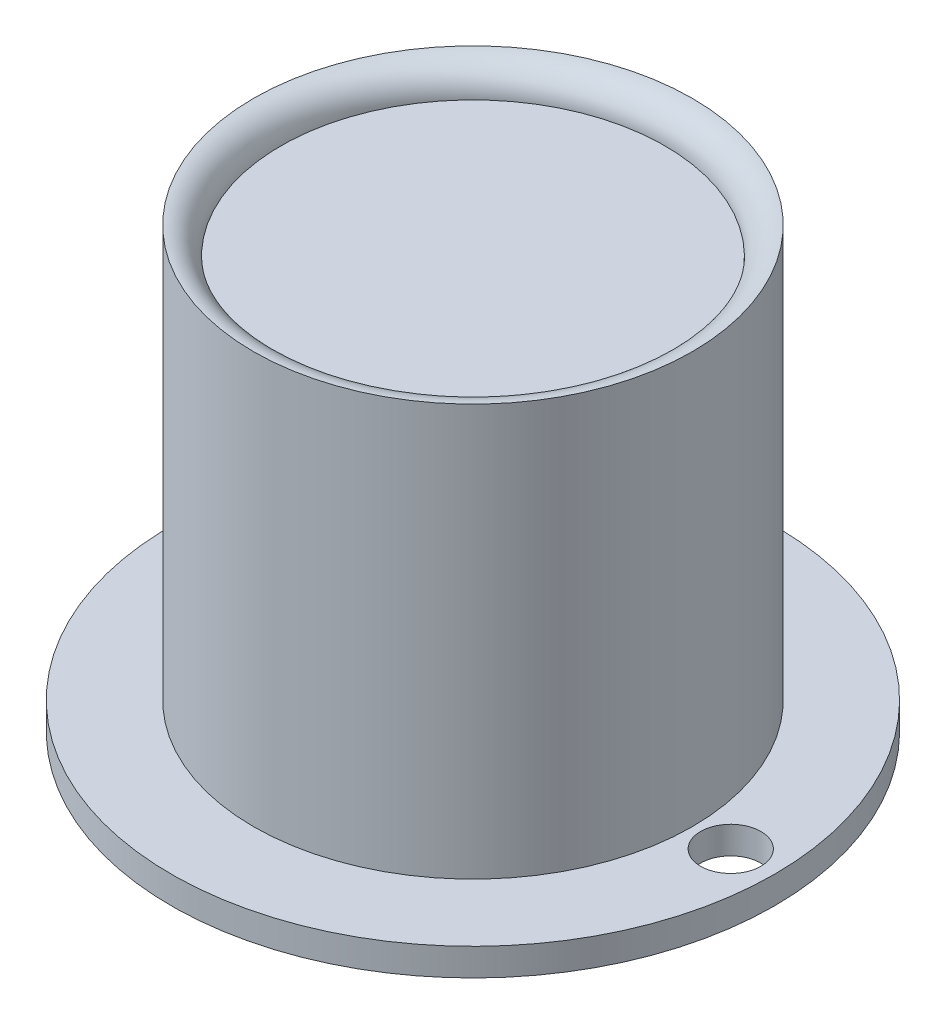
ISO-10303-21;
HEADER;
FILE_DESCRIPTION(('STEP AP214'),'2;1');
FILE_NAME('part.step','',(''),(''),'','','');
FILE_SCHEMA(('AUTOMOTIVE_DESIGN { 1 0 10303 214 1 1 1 1 }'));
ENDSEC;
DATA;
#1=APPLICATION_CONTEXT('core data for automotive mechanical design processes');
#2=APPLICATION_PROTOCOL_DEFINITION('international standard','automotive_design',2000,#1);
#3=PRODUCT_CONTEXT('',#1,'mechanical');
#4=PRODUCT('Part','Part','',(#3));
#5=PRODUCT_RELATED_PRODUCT_CATEGORY('part','',(#4));
#6=PRODUCT_DEFINITION_FORMATION('','',#4);
#7=PRODUCT_DEFINITION_CONTEXT('part definition',#1,'design');
#8=PRODUCT_DEFINITION('design','',#6,#7);
#9=PRODUCT_DEFINITION_SHAPE('','',#8);
#10=(LENGTH_UNIT() NAMED_UNIT(*) SI_UNIT(.MILLI.,.METRE.));
#11=(NAMED_UNIT(*) PLANE_ANGLE_UNIT() SI_UNIT($,.RADIAN.));
#12=(NAMED_UNIT(*) SI_UNIT($,.STERADIAN.) SOLID_ANGLE_UNIT());
#13=UNCERTAINTY_MEASURE_WITH_UNIT(LENGTH_MEASURE(1.E-05),#10,'distance_accuracy_value','');
#14=(GEOMETRIC_REPRESENTATION_CONTEXT(3) GLOBAL_UNCERTAINTY_ASSIGNED_CONTEXT((#13)) GLOBAL_UNIT_ASSIGNED_CONTEXT((#10,
#11,#12)) REPRESENTATION_CONTEXT('',''));
#15=CARTESIAN_POINT('',(0.,0.,0.));
#16=DIRECTION('',(0.,0.,1.));
#17=DIRECTION('',(1.,0.,0.));
#18=AXIS2_PLACEMENT_3D('',#15,#16,#17);
#19=CARTESIAN_POINT('',(0.,14.,0.));
#20=DIRECTION('',(0.,-1.,0.));
#21=DIRECTION('',(1.,0.,0.));
#22=AXIS2_PLACEMENT_3D('',#19,#20,#21);
#23=PLANE('',#22);
#24=CARTESIAN_POINT('',(0.,14.,0.));
#25=DIRECTION('',(0.,-1.,0.));
#26=DIRECTION('',(1.,0.,0.));
#27=AXIS2_PLACEMENT_3D('',#24,#25,#26);
#28=CIRCLE('',#27,7.);
#29=CARTESIAN_POINT('',(7.,14.,0.));
#30=VERTEX_POINT('',#29);
#31=EDGE_CURVE('E10',#30,#30,#28,.T.);
#32=ORIENTED_EDGE('',*,*,#31,.F.);
#33=EDGE_LOOP('',(#32));
#34=FACE_BOUND('',#33,.T.);
#35=ADVANCED_FACE('F39',(#34),#23,.F.);
#36=CARTESIAN_POINT('',(0.,14.,0.));
#37=DIRECTION('',(0.,-1.,0.));
#38=DIRECTION('',(1.,0.,0.));
#39=AXIS2_PLACEMENT_3D('',#36,#37,#38);
#40=TOROIDAL_SURFACE('',#39,8.,1.);
#41=CARTESIAN_POINT('',(0.,15.,0.));
#42=DIRECTION('',(0.,-1.,0.));
#43=DIRECTION('',(1.,0.,0.));
#44=AXIS2_PLACEMENT_3D('',#41,#42,#43);
#45=CIRCLE('',#44,8.);
#46=CARTESIAN_POINT('',(8.,15.,0.));
#47=VERTEX_POINT('',#46);
#48=EDGE_CURVE('E45',#47,#47,#45,.T.);
#49=ORIENTED_EDGE('',*,*,#48,.F.);
#50=EDGE_LOOP('',(#49));
#51=FACE_BOUND('',#50,.T.);
#52=ORIENTED_EDGE('',*,*,#31,.T.);
#53=EDGE_LOOP('',(#52));
#54=FACE_BOUND('',#53,.T.);
#55=ADVANCED_FACE('F112',(#51,#54),#40,.T.);
#56=CARTESIAN_POINT('',(0.,0.,0.));
#57=DIRECTION('',(0.,-1.,0.));
#58=DIRECTION('',(1.,0.,0.));
#59=AXIS2_PLACEMENT_3D('',#56,#57,#58);
#60=CYLINDRICAL_SURFACE('',#59,8.);
#61=CARTESIAN_POINT('',(0.,0.,0.));
#62=DIRECTION('',(0.,-1.,0.));
#63=DIRECTION('',(1.,0.,0.));
#64=AXIS2_PLACEMENT_3D('',#61,#62,#63);
#65=CIRCLE('',#64,8.);
#66=CARTESIAN_POINT('',(8.,0.,0.));
#67=VERTEX_POINT('',#66);
#68=EDGE_CURVE('E49',#67,#67,#65,.T.);
#69=ORIENTED_EDGE('',*,*,#68,.F.);
#70=EDGE_LOOP('',(#69));
#71=FACE_BOUND('',#70,.T.);
#72=ORIENTED_EDGE('',*,*,#48,.T.);
#73=EDGE_LOOP('',(#72));
#74=FACE_BOUND('',#73,.T.);
#75=ADVANCED_FACE('F86',(#71,#74),#60,.T.);
#76=CARTESIAN_POINT('',(0.,-1.,0.));
#77=DIRECTION('',(0.,-1.,0.));
#78=DIRECTION('',(1.,0.,0.));
#79=AXIS2_PLACEMENT_3D('',#76,#77,#78);
#80=PLANE('',#79);
#81=CARTESIAN_POINT('',(9.4,-0.999999999999999,0.));
#82=DIRECTION('',(0.,-1.,0.));
#83=DIRECTION('',(1.,0.,0.));
#84=AXIS2_PLACEMENT_3D('',#81,#82,#83);
#85=CIRCLE('',#84,1.1);
#86=CARTESIAN_POINT('',(10.5,-0.999999999999999,0.));
#87=VERTEX_POINT('',#86);
#88=EDGE_CURVE('E71',#87,#87,#85,.T.);
#89=ORIENTED_EDGE('',*,*,#88,.F.);
#90=EDGE_LOOP('',(#89));
#91=FACE_BOUND('',#90,.T.);
#92=CARTESIAN_POINT('',(-9.4,-1.,0.));
#93=DIRECTION('',(0.,-1.,0.));
#94=DIRECTION('',(-1.,0.,0.));
#95=AXIS2_PLACEMENT_3D('',#92,#93,#94);
#96=CIRCLE('',#95,1.1);
#97=CARTESIAN_POINT('',(-10.5,-1.,0.));
#98=VERTEX_POINT('',#97);
#99=EDGE_CURVE('E68',#98,#98,#96,.T.);
#100=ORIENTED_EDGE('',*,*,#99,.F.);
#101=EDGE_LOOP('',(#100));
#102=FACE_BOUND('',#101,.T.);
#103=CARTESIAN_POINT('',(0.,-1.,0.));
#104=DIRECTION('',(0.,-1.,0.));
#105=DIRECTION('',(1.,0.,0.));
#106=AXIS2_PLACEMENT_3D('',#103,#104,#105);
#107=CIRCLE('',#106,11.);
#108=CARTESIAN_POINT('',(11.,-0.999999999999999,0.));
#109=VERTEX_POINT('',#108);
#110=EDGE_CURVE('E58',#109,#109,#107,.T.);
#111=ORIENTED_EDGE('',*,*,#110,.T.);
#112=EDGE_LOOP('',(#111));
#113=FACE_BOUND('',#112,.T.);
#114=CARTESIAN_POINT('',(0.,-1.,0.));
#115=DIRECTION('',(0.,-1.,0.));
#116=DIRECTION('',(1.,0.,0.));
#117=AXIS2_PLACEMENT_3D('',#114,#115,#116);
#118=CIRCLE('',#117,7.);
#119=CARTESIAN_POINT('',(7.,-1.,0.));
#120=VERTEX_POINT('',#119);
#121=EDGE_CURVE('E62',#120,#120,#118,.T.);
#122=ORIENTED_EDGE('',*,*,#121,.F.);
#123=EDGE_LOOP('',(#122));
#124=FACE_BOUND('',#123,.T.);
#125=ADVANCED_FACE('F82',(#91,#102,#113,#124),#80,.T.);
#126=CARTESIAN_POINT('',(0.,0.,0.));
#127=DIRECTION('',(0.,-1.,0.));
#128=DIRECTION('',(1.,0.,0.));
#129=AXIS2_PLACEMENT_3D('',#126,#127,#128);
#130=PLANE('',#129);
#131=CARTESIAN_POINT('',(9.4,0.,0.));
#132=DIRECTION('',(0.,-1.,0.));
#133=DIRECTION('',(1.,0.,0.));
#134=AXIS2_PLACEMENT_3D('',#131,#132,#133);
#135=CIRCLE('',#134,1.1);
#136=CARTESIAN_POINT('',(10.5,0.,0.));
#137=VERTEX_POINT('',#136);
#138=EDGE_CURVE('E67',#137,#137,#135,.F.);
#139=ORIENTED_EDGE('',*,*,#138,.F.);
#140=EDGE_LOOP('',(#139));
#141=FACE_BOUND('',#140,.T.);
#142=CARTESIAN_POINT('',(-9.4,0.,0.));
#143=DIRECTION('',(0.,-1.,0.));
#144=DIRECTION('',(1.,0.,0.));
#145=AXIS2_PLACEMENT_3D('',#142,#143,#144);
#146=CIRCLE('',#145,1.1);
#147=CARTESIAN_POINT('',(-8.3,0.,0.));
#148=VERTEX_POINT('',#147);
#149=EDGE_CURVE('E72',#148,#148,#146,.F.);
#150=ORIENTED_EDGE('',*,*,#149,.F.);
#151=EDGE_LOOP('',(#150));
#152=FACE_BOUND('',#151,.T.);
#153=ORIENTED_EDGE('',*,*,#68,.T.);
#154=EDGE_LOOP('',(#153));
#155=FACE_BOUND('',#154,.T.);
#156=CARTESIAN_POINT('',(0.,0.,0.));
#157=DIRECTION('',(0.,-1.,0.));
#158=DIRECTION('',(1.,0.,0.));
#159=AXIS2_PLACEMENT_3D('',#156,#157,#158);
#160=CIRCLE('',#159,11.);
#161=CARTESIAN_POINT('',(11.,0.,0.));
#162=VERTEX_POINT('',#161);
#163=EDGE_CURVE('E59',#162,#162,#160,.T.);
#164=ORIENTED_EDGE('',*,*,#163,.F.);
#165=EDGE_LOOP('',(#164));
#166=FACE_BOUND('',#165,.T.);
#167=ADVANCED_FACE('F85',(#141,#152,#155,#166),#130,.F.);
#168=CARTESIAN_POINT('',(0.,-1.,0.));
#169=DIRECTION('',(0.,1.,0.));
#170=DIRECTION('',(-1.,0.,0.));
#171=AXIS2_PLACEMENT_3D('',#168,#169,#170);
#172=CYLINDRICAL_SURFACE('',#171,11.);
#173=ORIENTED_EDGE('',*,*,#110,.F.);
#174=EDGE_LOOP('',(#173));
#175=FACE_BOUND('',#174,.T.);
#176=ORIENTED_EDGE('',*,*,#163,.T.);
#177=EDGE_LOOP('',(#176));
#178=FACE_BOUND('',#177,.T.);
#179=ADVANCED_FACE('F106',(#175,#178),#172,.T.);
#180=CARTESIAN_POINT('',(0.,10.,0.));
#181=DIRECTION('',(0.,-1.,0.));
#182=DIRECTION('',(1.,0.,0.));
#183=AXIS2_PLACEMENT_3D('',#180,#181,#182);
#184=PLANE('',#183);
#185=CARTESIAN_POINT('',(0.,10.,0.));
#186=DIRECTION('',(0.,-1.,0.));
#187=DIRECTION('',(1.,0.,0.));
#188=AXIS2_PLACEMENT_3D('',#185,#186,#187);
#189=CIRCLE('',#188,7.);
#190=CARTESIAN_POINT('',(7.,10.,0.));
#191=VERTEX_POINT('',#190);
#192=EDGE_CURVE('E53',#191,#191,#189,.T.);
#193=ORIENTED_EDGE('',*,*,#192,.T.);
#194=EDGE_LOOP('',(#193));
#195=FACE_BOUND('',#194,.T.);
#196=ADVANCED_FACE('F97',(#195),#184,.T.);
#197=CARTESIAN_POINT('',(0.,10.,0.));
#198=DIRECTION('',(0.,-1.,0.));
#199=DIRECTION('',(1.,0.,0.));
#200=AXIS2_PLACEMENT_3D('',#197,#198,#199);
#201=CYLINDRICAL_SURFACE('',#200,7.);
#202=ORIENTED_EDGE('',*,*,#192,.F.);
#203=EDGE_LOOP('',(#202));
#204=FACE_BOUND('',#203,.T.);
#205=ORIENTED_EDGE('',*,*,#121,.T.);
#206=EDGE_LOOP('',(#205));
#207=FACE_BOUND('',#206,.T.);
#208=ADVANCED_FACE('F94',(#204,#207),#201,.F.);
#209=CARTESIAN_POINT('',(-9.4,3.11126983722081,0.));
#210=DIRECTION('',(0.,-1.,0.));
#211=DIRECTION('',(1.,0.,0.));
#212=AXIS2_PLACEMENT_3D('',#209,#210,#211);
#213=CYLINDRICAL_SURFACE('',#212,1.1);
#214=ORIENTED_EDGE('',*,*,#149,.T.);
#215=EDGE_LOOP('',(#214));
#216=FACE_BOUND('',#215,.T.);
#217=ORIENTED_EDGE('',*,*,#99,.T.);
#218=EDGE_LOOP('',(#217));
#219=FACE_BOUND('',#218,.T.);
#220=ADVANCED_FACE('F96',(#216,#219),#213,.F.);
#221=CARTESIAN_POINT('',(9.4,3.11126983722081,0.));
#222=DIRECTION('',(0.,-1.,0.));
#223=DIRECTION('',(1.,0.,0.));
#224=AXIS2_PLACEMENT_3D('',#221,#222,#223);
#225=CYLINDRICAL_SURFACE('',#224,1.1);
#226=ORIENTED_EDGE('',*,*,#138,.T.);
#227=EDGE_LOOP('',(#226));
#228=FACE_BOUND('',#227,.T.);
#229=ORIENTED_EDGE('',*,*,#88,.T.);
#230=EDGE_LOOP('',(#229));
#231=FACE_BOUND('',#230,.T.);
#232=ADVANCED_FACE('F80',(#228,#231),#225,.F.);
#233=CLOSED_SHELL('',(#35,#55,#75,#125,#167,#179,#196,#208,#220,#232));
#234=MANIFOLD_SOLID_BREP('B2',#233);
#235=ADVANCED_BREP_SHAPE_REPRESENTATION('',(#18,#234),#14);
#236=SHAPE_DEFINITION_REPRESENTATION(#9,#235);
ENDSEC;
END-ISO-10303-21;
